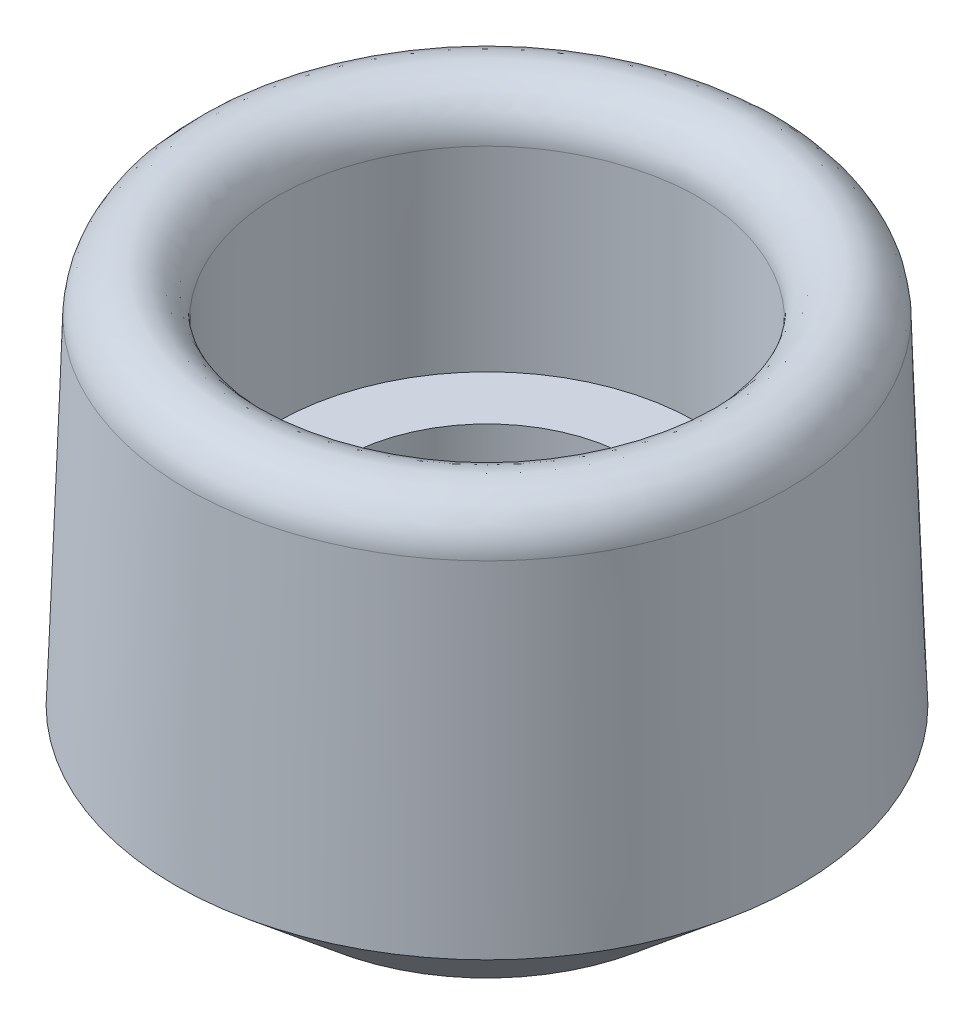
ISO-10303-21;
HEADER;
FILE_DESCRIPTION(('STEP AP214'),'2;1');
FILE_NAME('part.step','',(''),(''),'','','');
FILE_SCHEMA(('AUTOMOTIVE_DESIGN { 1 0 10303 214 1 1 1 1 }'));
ENDSEC;
DATA;
#1=APPLICATION_CONTEXT('core data for automotive mechanical design processes');
#2=APPLICATION_PROTOCOL_DEFINITION('international standard','automotive_design',2000,#1);
#3=PRODUCT_CONTEXT('',#1,'mechanical');
#4=PRODUCT('Part','Part','',(#3));
#5=PRODUCT_RELATED_PRODUCT_CATEGORY('part','',(#4));
#6=PRODUCT_DEFINITION_FORMATION('','',#4);
#7=PRODUCT_DEFINITION_CONTEXT('part definition',#1,'design');
#8=PRODUCT_DEFINITION('design','',#6,#7);
#9=PRODUCT_DEFINITION_SHAPE('','',#8);
#10=(LENGTH_UNIT() NAMED_UNIT(*) SI_UNIT(.MILLI.,.METRE.));
#11=(NAMED_UNIT(*) PLANE_ANGLE_UNIT() SI_UNIT($,.RADIAN.));
#12=(NAMED_UNIT(*) SI_UNIT($,.STERADIAN.) SOLID_ANGLE_UNIT());
#13=UNCERTAINTY_MEASURE_WITH_UNIT(LENGTH_MEASURE(1.E-05),#10,'distance_accuracy_value','');
#14=(GEOMETRIC_REPRESENTATION_CONTEXT(3) GLOBAL_UNCERTAINTY_ASSIGNED_CONTEXT((#13)) GLOBAL_UNIT_ASSIGNED_CONTEXT((#10,
#11,#12)) REPRESENTATION_CONTEXT('',''));
#15=CARTESIAN_POINT('',(0.,0.,0.));
#16=DIRECTION('',(0.,0.,1.));
#17=DIRECTION('',(1.,0.,0.));
#18=AXIS2_PLACEMENT_3D('',#15,#16,#17);
#19=CARTESIAN_POINT('',(3.49619752828577E-12,2.21850837283063,-1.3125));
#20=CARTESIAN_POINT('',(-0.336666333563799,2.21850837283063,-1.3125000000009));
#21=CARTESIAN_POINT('',(-0.690018602841466,2.21850837283074,-1.16613669777195));
#22=CARTESIAN_POINT('',(-1.16613669776828,2.21850837283053,-0.690018602847681));
#23=CARTESIAN_POINT('',(-1.3124999999991,2.21850837283063,-0.336666333570968));
#24=CARTESIAN_POINT('',(-1.3125000000009,2.21850837283063,0.336666333563973));
#25=CARTESIAN_POINT('',(-1.16613669777195,2.21850837283074,0.690018602841466));
#26=CARTESIAN_POINT('',(-0.690018602847681,2.21850837283053,1.16613669776828));
#27=CARTESIAN_POINT('',(-0.336666333571074,2.21850837283063,1.3124999999991));
#28=CARTESIAN_POINT('',(0.336666333564082,2.21850837283063,1.3125000000009));
#29=CARTESIAN_POINT('',(0.690018602841527,2.21850837283063,1.16613669777189));
#30=CARTESIAN_POINT('',(1.16613669776822,2.21850837283063,0.69001860284774));
#31=CARTESIAN_POINT('',(1.3124999999991,2.21850837283063,0.336666333570979));
#32=CARTESIAN_POINT('',(1.3125000000009,2.21850837283063,-0.336666333563985));
#33=CARTESIAN_POINT('',(1.16613669777197,2.21850837283063,-0.690018602841448));
#34=CARTESIAN_POINT('',(0.690018602847661,2.21850837283063,-1.16613669776829));
#35=CARTESIAN_POINT('',(0.336666333570792,2.21850837283063,-1.3124999999991));
#36=CARTESIAN_POINT('',(3.49619752828577E-12,2.21850837283063,-1.3125));
#37=CARTESIAN_POINT('',(3.49619752828577E-12,2.75940070961209,-1.3125));
#38=CARTESIAN_POINT('',(-0.336666333563799,2.75940070961209,-1.3125000000009));
#39=CARTESIAN_POINT('',(-0.690018602841426,2.75940070961209,-1.16613669777194));
#40=CARTESIAN_POINT('',(-1.16613669776831,2.75940070961209,-0.690018602847693));
#41=CARTESIAN_POINT('',(-1.3124999999991,2.75940070961209,-0.336666333570968));
#42=CARTESIAN_POINT('',(-1.3125000000009,2.75940070961209,0.336666333563973));
#43=CARTESIAN_POINT('',(-1.16613669777196,2.75940070961209,0.690018602841451));
#44=CARTESIAN_POINT('',(-0.690018602847666,2.75940070961209,1.16613669776829));
#45=CARTESIAN_POINT('',(-0.336666333571074,2.75940070961209,1.3124999999991));
#46=CARTESIAN_POINT('',(0.336666333564082,2.75940070961209,1.3125000000009));
#47=CARTESIAN_POINT('',(0.690018602841486,2.75940070961219,1.16613669777185));
#48=CARTESIAN_POINT('',(1.16613669776825,2.75940070961198,0.690018602847779));
#49=CARTESIAN_POINT('',(1.3124999999991,2.75940070961209,0.336666333570979));
#50=CARTESIAN_POINT('',(1.3125000000009,2.75940070961209,-0.336666333563985));
#51=CARTESIAN_POINT('',(1.16613669777193,2.75940070961219,-0.690018602841434));
#52=CARTESIAN_POINT('',(0.690018602847701,2.75940070961198,-1.16613669776831));
#53=CARTESIAN_POINT('',(0.336666333570792,2.75940070961209,-1.3124999999991));
#54=CARTESIAN_POINT('',(3.49619752828577E-12,2.75940070961209,-1.3125));
#55=CARTESIAN_POINT('',(5.03756200479342E-12,2.76884058251241,-1.85330995625869));
#56=CARTESIAN_POINT('',(-0.485074190084765,2.76884058251241,-1.85330995625996));
#57=CARTESIAN_POINT('',(-0.967488788515408,2.7688405825123,-1.65348728690476));
#58=CARTESIAN_POINT('',(-1.65348728689959,2.76884058251251,-0.96748878852449));
#59=CARTESIAN_POINT('',(-1.85330995625742,2.76884058251241,-0.485074190094692));
#60=CARTESIAN_POINT('',(-1.85330995625996,2.76884058251241,0.485074190084615));
#61=CARTESIAN_POINT('',(-1.65348728690466,2.76884058251241,0.967488788515514));
#62=CARTESIAN_POINT('',(-0.967488788524596,2.76884058251241,1.65348728689949));
#63=CARTESIAN_POINT('',(-0.485074190094719,2.76884058251241,1.85330995625742));
#64=CARTESIAN_POINT('',(0.485074190084643,2.76884058251241,1.85330995625996));
#65=CARTESIAN_POINT('',(0.967488788515597,2.76884058251251,1.65348728690468));
#66=CARTESIAN_POINT('',(1.6534872868994,2.7688405825123,0.967488788524574));
#67=CARTESIAN_POINT('',(1.85330995625742,2.76884058251241,0.485074190094721));
#68=CARTESIAN_POINT('',(1.85330995625996,2.76884058251241,-0.485074190084643));
#69=CARTESIAN_POINT('',(1.65348728690473,2.76884058251251,-0.967488788515543));
#70=CARTESIAN_POINT('',(0.967488788524519,2.7688405825123,-1.65348728689945));
#71=CARTESIAN_POINT('',(0.48507419009484,2.76884058251241,-1.85330995625742));
#72=CARTESIAN_POINT('',(5.03756200479342E-12,2.76884058251241,-1.85330995625869));
#73=CARTESIAN_POINT('',(5.09137436238721E-12,2.2282777427281,-1.8721868265826));
#74=CARTESIAN_POINT('',(-0.490254338548617,2.2282777427281,-1.87218682658393));
#75=CARTESIAN_POINT('',(-0.977173833422646,2.22827774272821,-1.67049816802482));
#76=CARTESIAN_POINT('',(-1.67049816801951,2.22827774272799,-0.97717383343174));
#77=CARTESIAN_POINT('',(-1.87218682658127,2.2282777427281,-0.490254338558642));
#78=CARTESIAN_POINT('',(-1.87218682658393,2.2282777427281,0.490254338548457));
#79=CARTESIAN_POINT('',(-1.67049816802472,2.22827774272821,0.977173833422751));
#80=CARTESIAN_POINT('',(-0.977173833431845,2.22827774272799,1.6704981680194));
#81=CARTESIAN_POINT('',(-0.490254338558666,2.2282777427281,1.87218682658127));
#82=CARTESIAN_POINT('',(0.490254338548482,2.2282777427281,1.87218682658393));
#83=CARTESIAN_POINT('',(0.97717383342278,2.2282777427281,1.67049816802469));
#84=CARTESIAN_POINT('',(1.67049816801938,2.2282777427281,0.977173833431868));
#85=CARTESIAN_POINT('',(1.87218682658127,2.2282777427281,0.490254338558671));
#86=CARTESIAN_POINT('',(1.87218682658393,2.2282777427281,-0.490254338548485));
#87=CARTESIAN_POINT('',(1.67049816802475,2.2282777427281,-0.977173833422727));
#88=CARTESIAN_POINT('',(0.977173833431815,2.2282777427281,-1.67049816801943));
#89=CARTESIAN_POINT('',(0.4902543385588,2.2282777427281,-1.87218682658127));
#90=CARTESIAN_POINT('',(5.09137436238721E-12,2.2282777427281,-1.8721868265826));
#91=(BOUNDED_SURFACE() B_SPLINE_SURFACE(3,3,((#19,#20,#21,#22,#23,#24,#25,#26,#27,#28,#29,#30,
#31,#32,#33,#34,#35,#36),(#37,#38,#39,#40,#41,#42,#43,#44,#45,#46,#47,#48,#49,#50,#51,#52,#53,
#54),(#55,#56,#57,#58,#59,#60,#61,#62,#63,#64,#65,#66,#67,#68,#69,#70,#71,#72),(#73,#74,#75,#76,
#77,#78,#79,#80,#81,#82,#83,#84,#85,#86,#87,#88,#89,#90)),.UNSPECIFIED.,.F.,.T.,
.F.) B_SPLINE_SURFACE_WITH_KNOTS((4,4),(4,2,2,2,2,2,2,2,4),(0.,1.),(0.499999999999567,
0.624999999999567,0.749999999999567,0.874999999999567,0.999999999999567,1.12499999999957,
1.24999999999957,1.37499999999957,1.49999999999957),
.UNSPECIFIED.) GEOMETRIC_REPRESENTATION_ITEM() RATIONAL_B_SPLINE_SURFACE(((1.,1.,1.,1.,1.,1.,1.,
1.,1.,1.,1.,1.,1.,1.,1.,1.,1.,1.),(0.344968270958188,0.344968270958188,0.344968270958188,
0.344968270958188,0.344968270958188,0.344968270958188,0.344968270958187,0.344968270958187,
0.344968270958188,0.344968270958188,0.344968270958187,0.344968270958187,0.344968270958187,
0.344968270958187,0.344968270958189,0.344968270958189,0.344968270958188,0.344968270958188),
(0.344968270958188,0.344968270958188,0.344968270958188,0.344968270958188,0.344968270958188,
0.344968270958188,0.344968270958187,0.344968270958187,0.344968270958188,0.344968270958188,
0.344968270958187,0.344968270958187,0.344968270958187,0.344968270958187,0.344968270958189,
0.344968270958189,0.344968270958188,0.344968270958188),(1.,1.,1.,1.,1.,1.,1.,1.,1.,1.,1.,1.,1.,
1.,1.,1.,1.,1.))) REPRESENTATION_ITEM('') SURFACE());
#92=CARTESIAN_POINT('',(5.09137436238721E-12,2.2282777427281,-1.8721868265826));
#93=CARTESIAN_POINT('',(-0.490254338548617,2.2282777427281,-1.87218682658393));
#94=CARTESIAN_POINT('',(-0.977173833422646,2.22827774272821,-1.67049816802482));
#95=CARTESIAN_POINT('',(-1.67049816801951,2.22827774272799,-0.97717383343174));
#96=CARTESIAN_POINT('',(-1.87218682658127,2.2282777427281,-0.490254338558642));
#97=CARTESIAN_POINT('',(-1.87218682658393,2.2282777427281,0.490254338548457));
#98=CARTESIAN_POINT('',(-1.67049816802472,2.22827774272821,0.977173833422751));
#99=CARTESIAN_POINT('',(-0.977173833431845,2.22827774272799,1.6704981680194));
#100=CARTESIAN_POINT('',(-0.490254338558666,2.2282777427281,1.87218682658127));
#101=CARTESIAN_POINT('',(0.490254338548482,2.2282777427281,1.87218682658393));
#102=CARTESIAN_POINT('',(0.97717383342278,2.2282777427281,1.67049816802469));
#103=CARTESIAN_POINT('',(1.67049816801938,2.2282777427281,0.977173833431868));
#104=CARTESIAN_POINT('',(1.87218682658127,2.2282777427281,0.490254338558671));
#105=CARTESIAN_POINT('',(1.87218682658393,2.2282777427281,-0.490254338548485));
#106=CARTESIAN_POINT('',(1.67049816802475,2.2282777427281,-0.977173833422727));
#107=CARTESIAN_POINT('',(0.977173833431815,2.2282777427281,-1.67049816801943));
#108=CARTESIAN_POINT('',(0.4902543385588,2.2282777427281,-1.87218682658127));
#109=CARTESIAN_POINT('',(5.09137436238721E-12,2.2282777427281,-1.8721868265826));
#110=(BOUNDED_CURVE() B_SPLINE_CURVE(3,(#92,#93,#94,#95,#96,#97,#98,#99,#100,#101,#102,#103,
#104,#105,#106,#107,#108,#109),.UNSPECIFIED.,.T.,.F.) B_SPLINE_CURVE_WITH_KNOTS((4,2,2,2,2,2,2,
2,4),(0.499999999999567,0.624999999999567,0.749999999999567,0.874999999999567,0.999999999999567,
1.12499999999957,1.24999999999957,1.37499999999957,1.49999999999957),
.UNSPECIFIED.) CURVE() GEOMETRIC_REPRESENTATION_ITEM() RATIONAL_B_SPLINE_CURVE((1.,1.,1.,1.,1.,
1.,1.,1.,1.,1.,1.,1.,1.,1.,1.,1.,1.,1.)) REPRESENTATION_ITEM(''));
#111=CARTESIAN_POINT('',(5.09137436238721E-12,2.2282777427281,-1.8721868265826));
#112=VERTEX_POINT('',#111);
#113=EDGE_CURVE('E45',#112,#112,#110,.F.);
#114=CARTESIAN_POINT('',(3.49619752828577E-12,2.21850837283063,-1.3125));
#115=CARTESIAN_POINT('',(0.336666333570792,2.21850837283063,-1.3124999999991));
#116=CARTESIAN_POINT('',(0.690018602847661,2.21850837283063,-1.16613669776829));
#117=CARTESIAN_POINT('',(1.16613669777197,2.21850837283063,-0.690018602841448));
#118=CARTESIAN_POINT('',(1.3125000000009,2.21850837283063,-0.336666333563985));
#119=CARTESIAN_POINT('',(1.3124999999991,2.21850837283063,0.336666333570979));
#120=CARTESIAN_POINT('',(1.16613669776822,2.21850837283063,0.69001860284774));
#121=CARTESIAN_POINT('',(0.690018602841527,2.21850837283063,1.16613669777189));
#122=CARTESIAN_POINT('',(0.336666333564082,2.21850837283063,1.3125000000009));
#123=CARTESIAN_POINT('',(-0.336666333571074,2.21850837283063,1.3124999999991));
#124=CARTESIAN_POINT('',(-0.690018602847681,2.21850837283053,1.16613669776828));
#125=CARTESIAN_POINT('',(-1.16613669777195,2.21850837283074,0.690018602841466));
#126=CARTESIAN_POINT('',(-1.3125000000009,2.21850837283063,0.336666333563973));
#127=CARTESIAN_POINT('',(-1.3124999999991,2.21850837283063,-0.336666333570968));
#128=CARTESIAN_POINT('',(-1.16613669776828,2.21850837283053,-0.690018602847681));
#129=CARTESIAN_POINT('',(-0.690018602841466,2.21850837283074,-1.16613669777195));
#130=CARTESIAN_POINT('',(-0.336666333563799,2.21850837283063,-1.3125000000009));
#131=CARTESIAN_POINT('',(3.49619752828577E-12,2.21850837283063,-1.3125));
#132=(BOUNDED_CURVE() B_SPLINE_CURVE(3,(#114,#115,#116,#117,#118,#119,#120,#121,#122,#123,#124,
#125,#126,#127,#128,#129,#130,#131),.UNSPECIFIED.,.T.,.F.) B_SPLINE_CURVE_WITH_KNOTS((4,2,2,2,2,
2,2,2,4),(0.499999999999567,0.624999999999567,0.749999999999567,0.874999999999567,
0.999999999999567,1.12499999999957,1.24999999999957,1.37499999999957,1.49999999999957),
.UNSPECIFIED.) CURVE() GEOMETRIC_REPRESENTATION_ITEM() RATIONAL_B_SPLINE_CURVE((1.,1.,1.,1.,1.,
1.,1.,1.,1.,1.,1.,1.,1.,1.,1.,1.,1.,1.)) REPRESENTATION_ITEM(''));
#133=CARTESIAN_POINT('',(3.49619752828577E-12,2.21850837283063,-1.3125));
#134=VERTEX_POINT('',#133);
#135=EDGE_CURVE('E10',#134,#134,#132,.F.);
#136=ORIENTED_EDGE('',*,*,#113,.F.);
#137=EDGE_LOOP('',(#136));
#138=FACE_BOUND('',#137,.T.);
#139=ORIENTED_EDGE('',*,*,#135,.F.);
#140=EDGE_LOOP('',(#139));
#141=FACE_BOUND('',#140,.T.);
#142=ADVANCED_FACE('F34',(#138,#141),#91,.T.);
#143=CARTESIAN_POINT('',(0.,2.49843704861487,0.));
#144=DIRECTION('',(0.,-1.,0.));
#145=DIRECTION('',(0.,0.,-1.));
#146=AXIS2_PLACEMENT_3D('',#143,#144,#145);
#147=CYLINDRICAL_SURFACE('',#146,0.9144);
#148=CARTESIAN_POINT('',(0.,-0.501562951385132,0.));
#149=DIRECTION('',(0.,-1.,0.));
#150=DIRECTION('',(0.,0.,-1.));
#151=AXIS2_PLACEMENT_3D('',#148,#149,#150);
#152=CIRCLE('',#151,0.9144);
#153=CARTESIAN_POINT('',(0.,-0.501562951385132,-0.9144));
#154=VERTEX_POINT('',#153);
#155=EDGE_CURVE('E60',#154,#154,#152,.T.);
#156=ORIENTED_EDGE('',*,*,#155,.T.);
#157=EDGE_LOOP('',(#156));
#158=FACE_BOUND('',#157,.T.);
#159=CARTESIAN_POINT('',(0.,0.998437048614868,0.));
#160=DIRECTION('',(0.,1.,0.));
#161=DIRECTION('',(0.,0.,1.));
#162=AXIS2_PLACEMENT_3D('',#159,#160,#161);
#163=CIRCLE('',#162,0.9144);
#164=CARTESIAN_POINT('',(0.,0.998437048614868,0.9144));
#165=VERTEX_POINT('',#164);
#166=EDGE_CURVE('E63',#165,#165,#163,.F.);
#167=ORIENTED_EDGE('',*,*,#166,.F.);
#168=EDGE_LOOP('',(#167));
#169=FACE_BOUND('',#168,.T.);
#170=ADVANCED_FACE('F79',(#158,#169),#147,.F.);
#171=CARTESIAN_POINT('',(0.,0.,0.));
#172=DIRECTION('',(0.,-1.,0.));
#173=DIRECTION('',(0.,0.,1.));
#174=AXIS2_PLACEMENT_3D('',#171,#172,#173);
#175=CONICAL_SURFACE('',#174,1.95,0.0349065850398867);
#176=ORIENTED_EDGE('',*,*,#113,.T.);
#177=EDGE_LOOP('',(#176));
#178=FACE_BOUND('',#177,.T.);
#179=CARTESIAN_POINT('',(0.,0.124124670312417,0.));
#180=DIRECTION('',(0.,-1.,0.));
#181=DIRECTION('',(0.,0.,-1.));
#182=AXIS2_PLACEMENT_3D('',#179,#180,#181);
#183=CIRCLE('',#182,1.94566547099978);
#184=CARTESIAN_POINT('',(0.,0.124124670312417,-1.94566547099978));
#185=VERTEX_POINT('',#184);
#186=EDGE_CURVE('E55',#185,#185,#183,.F.);
#187=ORIENTED_EDGE('',*,*,#186,.T.);
#188=EDGE_LOOP('',(#187));
#189=FACE_BOUND('',#188,.T.);
#190=ADVANCED_FACE('F69',(#178,#189),#175,.T.);
#191=CARTESIAN_POINT('',(0.,-0.501562951385132,0.));
#192=DIRECTION('',(0.,1.,0.));
#193=DIRECTION('',(0.,0.,1.));
#194=AXIS2_PLACEMENT_3D('',#191,#192,#193);
#195=PLANE('',#194);
#196=CARTESIAN_POINT('',(0.,-0.501562951385132,0.));
#197=DIRECTION('',(0.,1.,0.));
#198=DIRECTION('',(0.,0.,1.));
#199=AXIS2_PLACEMENT_3D('',#196,#197,#198);
#200=CIRCLE('',#199,1.2);
#201=CARTESIAN_POINT('',(0.,-0.501562951385132,1.2));
#202=VERTEX_POINT('',#201);
#203=EDGE_CURVE('E50',#202,#202,#200,.F.);
#204=ORIENTED_EDGE('',*,*,#203,.T.);
#205=EDGE_LOOP('',(#204));
#206=FACE_BOUND('',#205,.T.);
#207=ORIENTED_EDGE('',*,*,#155,.F.);
#208=EDGE_LOOP('',(#207));
#209=FACE_BOUND('',#208,.T.);
#210=ADVANCED_FACE('F78',(#206,#209),#195,.F.);
#211=CARTESIAN_POINT('',(0.,0.998437048614868,0.));
#212=DIRECTION('',(0.,1.,0.));
#213=DIRECTION('',(0.,0.,1.));
#214=AXIS2_PLACEMENT_3D('',#211,#212,#213);
#215=PLANE('',#214);
#216=CARTESIAN_POINT('',(0.,0.998437048614868,0.));
#217=DIRECTION('',(0.,1.,0.));
#218=DIRECTION('',(0.,0.,1.));
#219=AXIS2_PLACEMENT_3D('',#216,#217,#218);
#220=CIRCLE('',#219,1.3125);
#221=CARTESIAN_POINT('',(0.,0.998437048614868,1.3125));
#222=VERTEX_POINT('',#221);
#223=EDGE_CURVE('E160',#222,#222,#220,.T.);
#224=ORIENTED_EDGE('',*,*,#223,.T.);
#225=EDGE_LOOP('',(#224));
#226=FACE_BOUND('',#225,.T.);
#227=ORIENTED_EDGE('',*,*,#166,.T.);
#228=EDGE_LOOP('',(#227));
#229=FACE_BOUND('',#228,.T.);
#230=ADVANCED_FACE('F87',(#226,#229),#215,.T.);
#231=CARTESIAN_POINT('',(0.,0.998437048614868,0.));
#232=DIRECTION('',(0.,1.,0.));
#233=DIRECTION('',(0.,0.,1.));
#234=AXIS2_PLACEMENT_3D('',#231,#232,#233);
#235=CYLINDRICAL_SURFACE('',#234,1.3125);
#236=ORIENTED_EDGE('',*,*,#135,.T.);
#237=EDGE_LOOP('',(#236));
#238=FACE_BOUND('',#237,.T.);
#239=ORIENTED_EDGE('',*,*,#223,.F.);
#240=EDGE_LOOP('',(#239));
#241=FACE_BOUND('',#240,.T.);
#242=ADVANCED_FACE('F83',(#238,#241),#235,.F.);
#243=CARTESIAN_POINT('',(0.,0.127761771997828,0.));
#244=DIRECTION('',(0.,1.,0.));
#245=DIRECTION('',(0.,0.,1.));
#246=AXIS2_PLACEMENT_3D('',#243,#244,#245);
#247=CONICAL_SURFACE('',#246,1.95,0.872664625997167);
#248=ORIENTED_EDGE('',*,*,#203,.F.);
#249=EDGE_LOOP('',(#248));
#250=FACE_BOUND('',#249,.T.);
#251=ORIENTED_EDGE('',*,*,#186,.F.);
#252=EDGE_LOOP('',(#251));
#253=FACE_BOUND('',#252,.T.);
#254=ADVANCED_FACE('F80',(#250,#253),#247,.T.);
#255=CLOSED_SHELL('',(#142,#170,#190,#210,#230,#242,#254));
#256=MANIFOLD_SOLID_BREP('B2',#255);
#257=ADVANCED_BREP_SHAPE_REPRESENTATION('',(#18,#256),#14);
#258=SHAPE_DEFINITION_REPRESENTATION(#9,#257);
ENDSEC;
END-ISO-10303-21;
